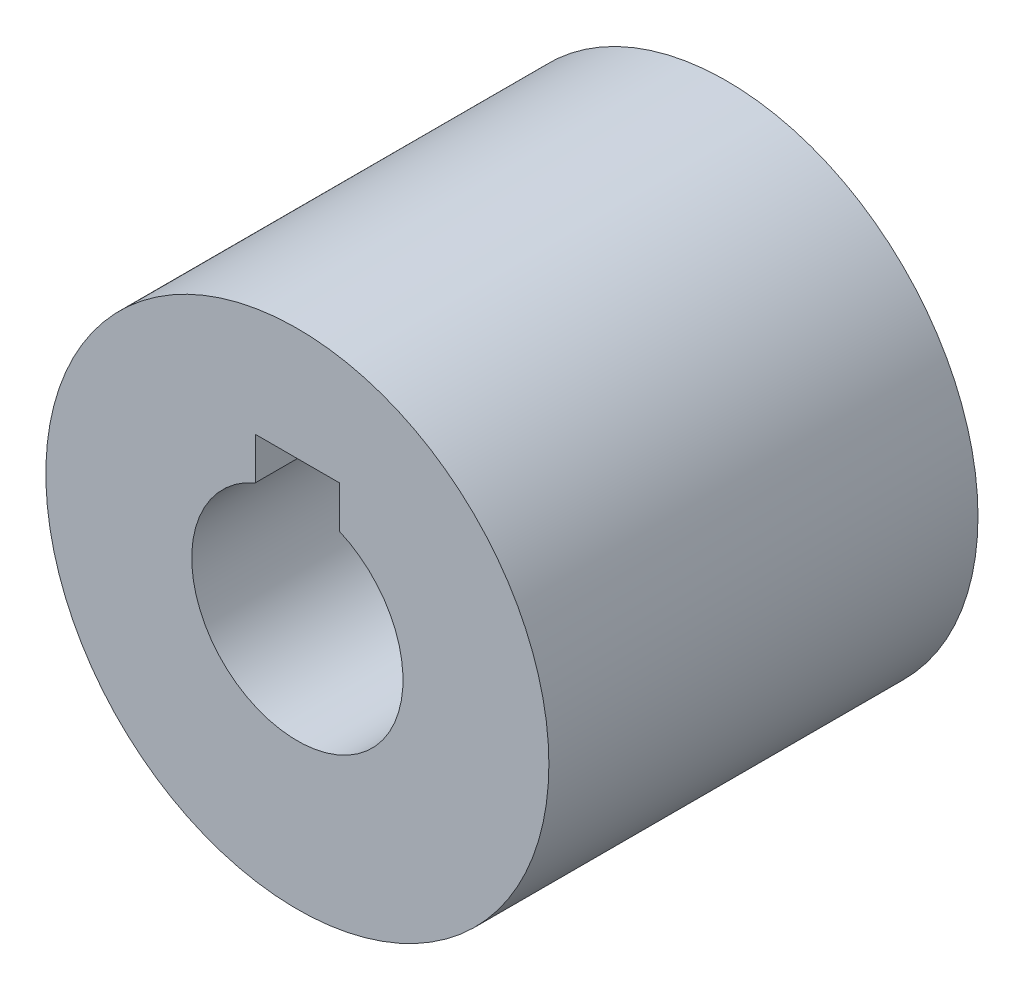
ISO-10303-21;
HEADER;
FILE_DESCRIPTION(('STEP AP214'),'2;1');
FILE_NAME('part.step','',(''),(''),'','','');
FILE_SCHEMA(('AUTOMOTIVE_DESIGN { 1 0 10303 214 1 1 1 1 }'));
ENDSEC;
DATA;
#1=APPLICATION_CONTEXT('core data for automotive mechanical design processes');
#2=APPLICATION_PROTOCOL_DEFINITION('international standard','automotive_design',2000,#1);
#3=PRODUCT_CONTEXT('',#1,'mechanical');
#4=PRODUCT('Part','Part','',(#3));
#5=PRODUCT_RELATED_PRODUCT_CATEGORY('part','',(#4));
#6=PRODUCT_DEFINITION_FORMATION('','',#4);
#7=PRODUCT_DEFINITION_CONTEXT('part definition',#1,'design');
#8=PRODUCT_DEFINITION('design','',#6,#7);
#9=PRODUCT_DEFINITION_SHAPE('','',#8);
#10=(LENGTH_UNIT() NAMED_UNIT(*) SI_UNIT(.MILLI.,.METRE.));
#11=(NAMED_UNIT(*) PLANE_ANGLE_UNIT() SI_UNIT($,.RADIAN.));
#12=(NAMED_UNIT(*) SI_UNIT($,.STERADIAN.) SOLID_ANGLE_UNIT());
#13=UNCERTAINTY_MEASURE_WITH_UNIT(LENGTH_MEASURE(1.E-05),#10,'distance_accuracy_value','');
#14=(GEOMETRIC_REPRESENTATION_CONTEXT(3) GLOBAL_UNCERTAINTY_ASSIGNED_CONTEXT((#13)) GLOBAL_UNIT_ASSIGNED_CONTEXT((#10,
#11,#12)) REPRESENTATION_CONTEXT('',''));
#15=CARTESIAN_POINT('',(0.,0.,0.));
#16=DIRECTION('',(0.,0.,1.));
#17=DIRECTION('',(1.,0.,0.));
#18=AXIS2_PLACEMENT_3D('',#15,#16,#17);
#19=CARTESIAN_POINT('',(0.,0.,16.25000012));
#20=DIRECTION('',(0.,0.,1.));
#21=DIRECTION('',(1.,0.,0.));
#22=AXIS2_PLACEMENT_3D('',#19,#20,#21);
#23=PLANE('',#22);
#24=DIRECTION('',(0.,-1.,0.));
#25=VECTOR('',#24,1.);
#26=CARTESIAN_POINT('',(-1.5875,5.25899067137586,16.25000012));
#27=LINE('',#26,#25);
#28=CARTESIAN_POINT('',(-1.5875,5.25899067137586,16.25000012));
#29=VERTEX_POINT('',#28);
#30=CARTESIAN_POINT('',(-1.5875,3.67149067137587,16.25000012));
#31=VERTEX_POINT('',#30);
#32=EDGE_CURVE('E80',#29,#31,#27,.T.);
#33=ORIENTED_EDGE('',*,*,#32,.F.);
#34=DIRECTION('',(-1.,0.,0.));
#35=VECTOR('',#34,1.);
#36=CARTESIAN_POINT('',(-1.5875,5.25899067137586,16.25000012));
#37=LINE('',#36,#35);
#38=CARTESIAN_POINT('',(1.5875,5.25899067137586,16.25000012));
#39=VERTEX_POINT('',#38);
#40=EDGE_CURVE('E92',#39,#29,#37,.T.);
#41=ORIENTED_EDGE('',*,*,#40,.F.);
#42=DIRECTION('',(0.,1.,0.));
#43=VECTOR('',#42,1.);
#44=CARTESIAN_POINT('',(1.5875,5.25899067137586,16.25000012));
#45=LINE('',#44,#43);
#46=CARTESIAN_POINT('',(1.5875,3.67149067137587,16.25000012));
#47=VERTEX_POINT('',#46);
#48=EDGE_CURVE('E104',#47,#39,#45,.T.);
#49=ORIENTED_EDGE('',*,*,#48,.F.);
#50=CARTESIAN_POINT('',(0.,0.,16.25000012));
#51=DIRECTION('',(0.,0.,1.));
#52=DIRECTION('',(1.,0.,0.));
#53=AXIS2_PLACEMENT_3D('',#50,#51,#52);
#54=CIRCLE('',#53,4.);
#55=EDGE_CURVE('E95',#31,#47,#54,.T.);
#56=ORIENTED_EDGE('',*,*,#55,.F.);
#57=EDGE_LOOP('',(#33,#41,#49,#56));
#58=FACE_BOUND('',#57,.T.);
#59=CARTESIAN_POINT('',(0.,0.,16.25000012));
#60=DIRECTION('',(0.,0.,1.));
#61=DIRECTION('',(1.,0.,0.));
#62=AXIS2_PLACEMENT_3D('',#59,#60,#61);
#63=CIRCLE('',#62,9.525);
#64=CARTESIAN_POINT('',(9.525,0.,16.25000012));
#65=VERTEX_POINT('',#64);
#66=EDGE_CURVE('E11',#65,#65,#63,.T.);
#67=ORIENTED_EDGE('',*,*,#66,.T.);
#68=EDGE_LOOP('',(#67));
#69=FACE_BOUND('',#68,.T.);
#70=ADVANCED_FACE('F33',(#58,#69),#23,.T.);
#71=CARTESIAN_POINT('',(0.,0.,0.));
#72=DIRECTION('',(0.,0.,1.));
#73=DIRECTION('',(1.,0.,0.));
#74=AXIS2_PLACEMENT_3D('',#71,#72,#73);
#75=PLANE('',#74);
#76=CARTESIAN_POINT('',(0.,0.,0.));
#77=DIRECTION('',(0.,0.,1.));
#78=DIRECTION('',(1.,0.,0.));
#79=AXIS2_PLACEMENT_3D('',#76,#77,#78);
#80=CIRCLE('',#79,9.525);
#81=CARTESIAN_POINT('',(9.525,0.,0.));
#82=VERTEX_POINT('',#81);
#83=EDGE_CURVE('E37',#82,#82,#80,.T.);
#84=ORIENTED_EDGE('',*,*,#83,.F.);
#85=EDGE_LOOP('',(#84));
#86=FACE_BOUND('',#85,.T.);
#87=DIRECTION('',(-1.,0.,0.));
#88=VECTOR('',#87,1.);
#89=CARTESIAN_POINT('',(-1.5875,5.25899067137586,0.));
#90=LINE('',#89,#88);
#91=CARTESIAN_POINT('',(1.5875,5.25899067137586,0.));
#92=VERTEX_POINT('',#91);
#93=CARTESIAN_POINT('',(-1.5875,5.25899067137586,0.));
#94=VERTEX_POINT('',#93);
#95=EDGE_CURVE('E86',#92,#94,#90,.T.);
#96=ORIENTED_EDGE('',*,*,#95,.T.);
#97=DIRECTION('',(0.,-1.,0.));
#98=VECTOR('',#97,1.);
#99=CARTESIAN_POINT('',(-1.5875,5.25899067137586,0.));
#100=LINE('',#99,#98);
#101=CARTESIAN_POINT('',(-1.5875,3.67149067137587,0.));
#102=VERTEX_POINT('',#101);
#103=EDGE_CURVE('E77',#94,#102,#100,.T.);
#104=ORIENTED_EDGE('',*,*,#103,.T.);
#105=CARTESIAN_POINT('',(0.,0.,0.));
#106=DIRECTION('',(0.,0.,1.));
#107=DIRECTION('',(1.,0.,0.));
#108=AXIS2_PLACEMENT_3D('',#105,#106,#107);
#109=CIRCLE('',#108,4.);
#110=CARTESIAN_POINT('',(1.5875,3.67149067137587,0.));
#111=VERTEX_POINT('',#110);
#112=EDGE_CURVE('E91',#102,#111,#109,.T.);
#113=ORIENTED_EDGE('',*,*,#112,.T.);
#114=DIRECTION('',(0.,1.,0.));
#115=VECTOR('',#114,1.);
#116=CARTESIAN_POINT('',(1.5875,5.25899067137586,0.));
#117=LINE('',#116,#115);
#118=EDGE_CURVE('E48',#111,#92,#117,.T.);
#119=ORIENTED_EDGE('',*,*,#118,.T.);
#120=EDGE_LOOP('',(#96,#104,#113,#119));
#121=FACE_BOUND('',#120,.T.);
#122=ADVANCED_FACE('F90',(#86,#121),#75,.F.);
#123=CARTESIAN_POINT('',(0.,0.,16.25000012));
#124=DIRECTION('',(0.,0.,-1.));
#125=DIRECTION('',(-1.,0.,0.));
#126=AXIS2_PLACEMENT_3D('',#123,#124,#125);
#127=CYLINDRICAL_SURFACE('',#126,9.525);
#128=ORIENTED_EDGE('',*,*,#66,.F.);
#129=EDGE_LOOP('',(#128));
#130=FACE_BOUND('',#129,.T.);
#131=ORIENTED_EDGE('',*,*,#83,.T.);
#132=EDGE_LOOP('',(#131));
#133=FACE_BOUND('',#132,.T.);
#134=ADVANCED_FACE('F35',(#130,#133),#127,.T.);
#135=CARTESIAN_POINT('',(0.,0.,16.25000012));
#136=DIRECTION('',(0.,0.,-1.));
#137=DIRECTION('',(-1.,0.,0.));
#138=AXIS2_PLACEMENT_3D('',#135,#136,#137);
#139=CYLINDRICAL_SURFACE('',#138,4.);
#140=DIRECTION('',(0.,0.,1.));
#141=VECTOR('',#140,1.);
#142=CARTESIAN_POINT('',(-1.5875,3.67149067137587,0.));
#143=LINE('',#142,#141);
#144=EDGE_CURVE('E74',#102,#31,#143,.T.);
#145=ORIENTED_EDGE('',*,*,#144,.T.);
#146=ORIENTED_EDGE('',*,*,#55,.T.);
#147=DIRECTION('',(0.,0.,1.));
#148=VECTOR('',#147,1.);
#149=CARTESIAN_POINT('',(1.5875,3.67149067137587,0.));
#150=LINE('',#149,#148);
#151=EDGE_CURVE('E85',#111,#47,#150,.T.);
#152=ORIENTED_EDGE('',*,*,#151,.F.);
#153=ORIENTED_EDGE('',*,*,#112,.F.);
#154=EDGE_LOOP('',(#145,#146,#152,#153));
#155=FACE_BOUND('',#154,.T.);
#156=ADVANCED_FACE('F94',(#155),#139,.F.);
#157=CARTESIAN_POINT('',(-1.5875,5.25899067137586,0.));
#158=DIRECTION('',(-1.,0.,0.));
#159=DIRECTION('',(0.,-1.,0.));
#160=AXIS2_PLACEMENT_3D('',#157,#158,#159);
#161=PLANE('',#160);
#162=ORIENTED_EDGE('',*,*,#32,.T.);
#163=ORIENTED_EDGE('',*,*,#144,.F.);
#164=ORIENTED_EDGE('',*,*,#103,.F.);
#165=DIRECTION('',(0.,0.,1.));
#166=VECTOR('',#165,1.);
#167=CARTESIAN_POINT('',(-1.5875,5.25899067137586,0.));
#168=LINE('',#167,#166);
#169=EDGE_CURVE('E57',#94,#29,#168,.T.);
#170=ORIENTED_EDGE('',*,*,#169,.T.);
#171=EDGE_LOOP('',(#162,#163,#164,#170));
#172=FACE_BOUND('',#171,.T.);
#173=ADVANCED_FACE('F76',(#172),#161,.F.);
#174=CARTESIAN_POINT('',(-1.5875,5.25899067137586,0.));
#175=DIRECTION('',(0.,1.,0.));
#176=DIRECTION('',(-1.,0.,0.));
#177=AXIS2_PLACEMENT_3D('',#174,#175,#176);
#178=PLANE('',#177);
#179=ORIENTED_EDGE('',*,*,#40,.T.);
#180=ORIENTED_EDGE('',*,*,#169,.F.);
#181=ORIENTED_EDGE('',*,*,#95,.F.);
#182=DIRECTION('',(0.,0.,1.));
#183=VECTOR('',#182,1.);
#184=CARTESIAN_POINT('',(1.5875,5.25899067137586,0.));
#185=LINE('',#184,#183);
#186=EDGE_CURVE('E98',#92,#39,#185,.T.);
#187=ORIENTED_EDGE('',*,*,#186,.T.);
#188=EDGE_LOOP('',(#179,#180,#181,#187));
#189=FACE_BOUND('',#188,.T.);
#190=ADVANCED_FACE('F114',(#189),#178,.F.);
#191=CARTESIAN_POINT('',(1.5875,5.25899067137586,0.));
#192=DIRECTION('',(1.,0.,0.));
#193=DIRECTION('',(0.,1.,0.));
#194=AXIS2_PLACEMENT_3D('',#191,#192,#193);
#195=PLANE('',#194);
#196=ORIENTED_EDGE('',*,*,#48,.T.);
#197=ORIENTED_EDGE('',*,*,#186,.F.);
#198=ORIENTED_EDGE('',*,*,#118,.F.);
#199=ORIENTED_EDGE('',*,*,#151,.T.);
#200=EDGE_LOOP('',(#196,#197,#198,#199));
#201=FACE_BOUND('',#200,.T.);
#202=ADVANCED_FACE('F111',(#201),#195,.F.);
#203=CLOSED_SHELL('',(#70,#122,#134,#156,#173,#190,#202));
#204=MANIFOLD_SOLID_BREP('B2',#203);
#205=ADVANCED_BREP_SHAPE_REPRESENTATION('',(#18,#204),#14);
#206=SHAPE_DEFINITION_REPRESENTATION(#9,#205);
ENDSEC;
END-ISO-10303-21;
